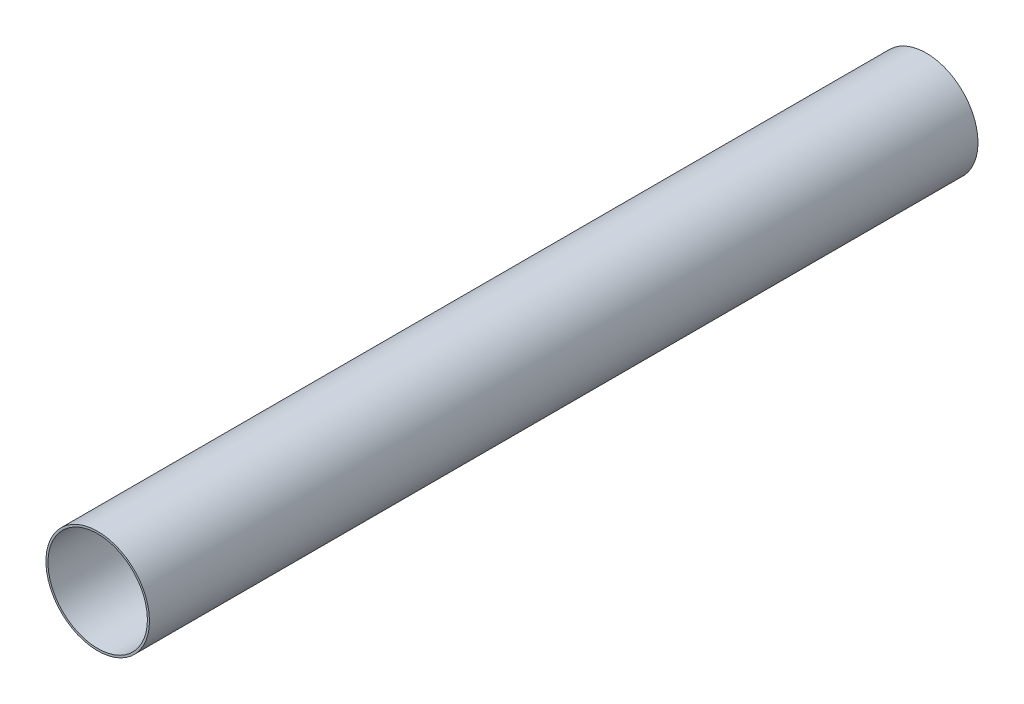
ISO-10303-21;
HEADER;
FILE_DESCRIPTION(('STEP AP214'),'2;1');
FILE_NAME('part.step','',(''),(''),'','','');
FILE_SCHEMA(('AUTOMOTIVE_DESIGN { 1 0 10303 214 1 1 1 1 }'));
ENDSEC;
DATA;
#1=APPLICATION_CONTEXT('core data for automotive mechanical design processes');
#2=APPLICATION_PROTOCOL_DEFINITION('international standard','automotive_design',2000,#1);
#3=PRODUCT_CONTEXT('',#1,'mechanical');
#4=PRODUCT('Part','Part','',(#3));
#5=PRODUCT_RELATED_PRODUCT_CATEGORY('part','',(#4));
#6=PRODUCT_DEFINITION_FORMATION('','',#4);
#7=PRODUCT_DEFINITION_CONTEXT('part definition',#1,'design');
#8=PRODUCT_DEFINITION('design','',#6,#7);
#9=PRODUCT_DEFINITION_SHAPE('','',#8);
#10=(LENGTH_UNIT() NAMED_UNIT(*) SI_UNIT(.MILLI.,.METRE.));
#11=(NAMED_UNIT(*) PLANE_ANGLE_UNIT() SI_UNIT($,.RADIAN.));
#12=(NAMED_UNIT(*) SI_UNIT($,.STERADIAN.) SOLID_ANGLE_UNIT());
#13=UNCERTAINTY_MEASURE_WITH_UNIT(LENGTH_MEASURE(1.E-05),#10,'distance_accuracy_value','');
#14=(GEOMETRIC_REPRESENTATION_CONTEXT(3) GLOBAL_UNCERTAINTY_ASSIGNED_CONTEXT((#13)) GLOBAL_UNIT_ASSIGNED_CONTEXT((#10,
#11,#12)) REPRESENTATION_CONTEXT('',''));
#15=CARTESIAN_POINT('',(0.,0.,0.));
#16=DIRECTION('',(0.,0.,1.));
#17=DIRECTION('',(1.,0.,0.));
#18=AXIS2_PLACEMENT_3D('',#15,#16,#17);
#19=CARTESIAN_POINT('',(0.,0.,400.));
#20=DIRECTION('',(0.,0.,1.));
#21=DIRECTION('',(1.,0.,0.));
#22=AXIS2_PLACEMENT_3D('',#19,#20,#21);
#23=PLANE('',#22);
#24=CARTESIAN_POINT('',(0.,0.,400.));
#25=DIRECTION('',(0.,0.,1.));
#26=DIRECTION('',(1.,0.,0.));
#27=AXIS2_PLACEMENT_3D('',#24,#25,#26);
#28=CIRCLE('',#27,25.);
#29=CARTESIAN_POINT('',(25.,0.,400.));
#30=VERTEX_POINT('',#29);
#31=EDGE_CURVE('E10',#30,#30,#28,.T.);
#32=ORIENTED_EDGE('',*,*,#31,.T.);
#33=EDGE_LOOP('',(#32));
#34=FACE_BOUND('',#33,.T.);
#35=CARTESIAN_POINT('',(0.,0.,400.));
#36=DIRECTION('',(0.,0.,1.));
#37=DIRECTION('',(1.,0.,0.));
#38=AXIS2_PLACEMENT_3D('',#35,#36,#37);
#39=CIRCLE('',#38,24.);
#40=CARTESIAN_POINT('',(24.,0.,400.));
#41=VERTEX_POINT('',#40);
#42=EDGE_CURVE('E26',#41,#41,#39,.T.);
#43=ORIENTED_EDGE('',*,*,#42,.F.);
#44=EDGE_LOOP('',(#43));
#45=FACE_BOUND('',#44,.T.);
#46=ADVANCED_FACE('F15',(#34,#45),#23,.T.);
#47=CARTESIAN_POINT('',(0.,0.,0.));
#48=DIRECTION('',(0.,0.,1.));
#49=DIRECTION('',(1.,0.,0.));
#50=AXIS2_PLACEMENT_3D('',#47,#48,#49);
#51=PLANE('',#50);
#52=CARTESIAN_POINT('',(0.,0.,0.));
#53=DIRECTION('',(0.,0.,1.));
#54=DIRECTION('',(1.,0.,0.));
#55=AXIS2_PLACEMENT_3D('',#52,#53,#54);
#56=CIRCLE('',#55,25.);
#57=CARTESIAN_POINT('',(25.,0.,0.));
#58=VERTEX_POINT('',#57);
#59=EDGE_CURVE('E19',#58,#58,#56,.T.);
#60=ORIENTED_EDGE('',*,*,#59,.F.);
#61=EDGE_LOOP('',(#60));
#62=FACE_BOUND('',#61,.T.);
#63=CARTESIAN_POINT('',(0.,0.,0.));
#64=DIRECTION('',(0.,0.,1.));
#65=DIRECTION('',(1.,0.,0.));
#66=AXIS2_PLACEMENT_3D('',#63,#64,#65);
#67=CIRCLE('',#66,24.);
#68=CARTESIAN_POINT('',(24.,0.,0.));
#69=VERTEX_POINT('',#68);
#70=EDGE_CURVE('E28',#69,#69,#67,.T.);
#71=ORIENTED_EDGE('',*,*,#70,.T.);
#72=EDGE_LOOP('',(#71));
#73=FACE_BOUND('',#72,.T.);
#74=ADVANCED_FACE('F38',(#62,#73),#51,.F.);
#75=CARTESIAN_POINT('',(0.,0.,400.));
#76=DIRECTION('',(0.,0.,-1.));
#77=DIRECTION('',(-1.,0.,0.));
#78=AXIS2_PLACEMENT_3D('',#75,#76,#77);
#79=CYLINDRICAL_SURFACE('',#78,25.);
#80=ORIENTED_EDGE('',*,*,#31,.F.);
#81=EDGE_LOOP('',(#80));
#82=FACE_BOUND('',#81,.T.);
#83=ORIENTED_EDGE('',*,*,#59,.T.);
#84=EDGE_LOOP('',(#83));
#85=FACE_BOUND('',#84,.T.);
#86=ADVANCED_FACE('F17',(#82,#85),#79,.T.);
#87=CARTESIAN_POINT('',(0.,0.,400.));
#88=DIRECTION('',(0.,0.,-1.));
#89=DIRECTION('',(-1.,0.,0.));
#90=AXIS2_PLACEMENT_3D('',#87,#88,#89);
#91=CYLINDRICAL_SURFACE('',#90,24.);
#92=ORIENTED_EDGE('',*,*,#42,.T.);
#93=EDGE_LOOP('',(#92));
#94=FACE_BOUND('',#93,.T.);
#95=ORIENTED_EDGE('',*,*,#70,.F.);
#96=EDGE_LOOP('',(#95));
#97=FACE_BOUND('',#96,.T.);
#98=ADVANCED_FACE('F34',(#94,#97),#91,.F.);
#99=CLOSED_SHELL('',(#46,#74,#86,#98));
#100=MANIFOLD_SOLID_BREP('B1',#99);
#101=ADVANCED_BREP_SHAPE_REPRESENTATION('',(#18,#100),#14);
#102=SHAPE_DEFINITION_REPRESENTATION(#9,#101);
ENDSEC;
END-ISO-10303-21;
